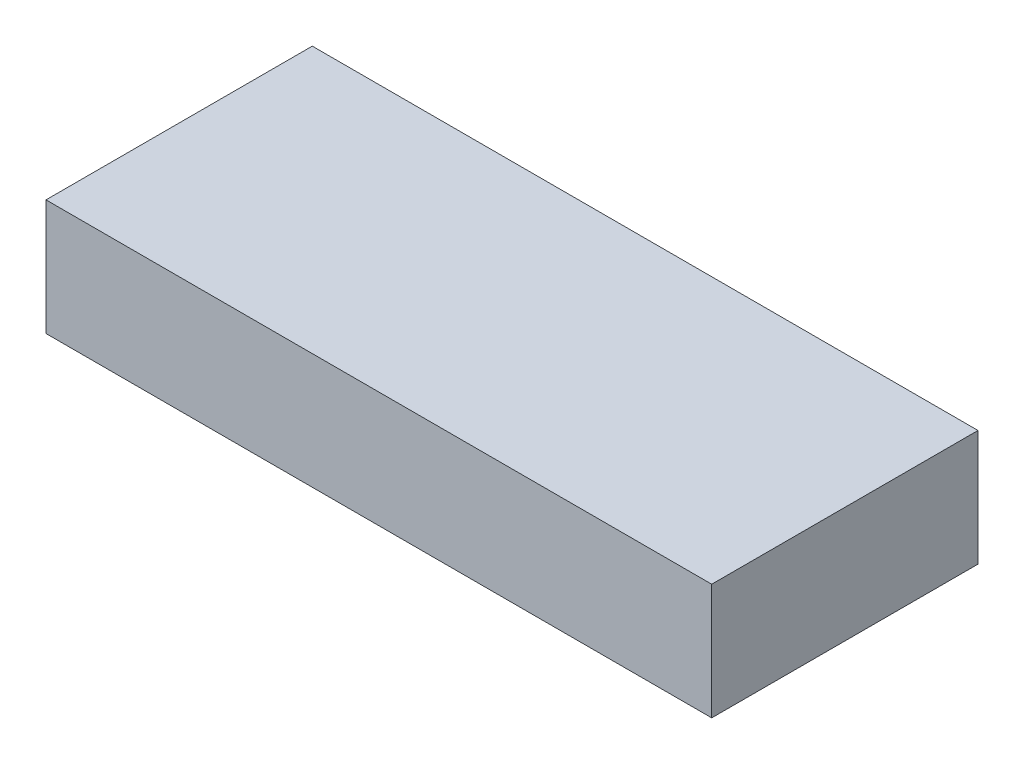
ISO-10303-21;
HEADER;
FILE_DESCRIPTION(('STEP AP214'),'2;1');
FILE_NAME('part.step','',(''),(''),'','','');
FILE_SCHEMA(('AUTOMOTIVE_DESIGN { 1 0 10303 214 1 1 1 1 }'));
ENDSEC;
DATA;
#1=APPLICATION_CONTEXT('core data for automotive mechanical design processes');
#2=APPLICATION_PROTOCOL_DEFINITION('international standard','automotive_design',2000,#1);
#3=PRODUCT_CONTEXT('',#1,'mechanical');
#4=PRODUCT('Part','Part','',(#3));
#5=PRODUCT_RELATED_PRODUCT_CATEGORY('part','',(#4));
#6=PRODUCT_DEFINITION_FORMATION('','',#4);
#7=PRODUCT_DEFINITION_CONTEXT('part definition',#1,'design');
#8=PRODUCT_DEFINITION('design','',#6,#7);
#9=PRODUCT_DEFINITION_SHAPE('','',#8);
#10=(LENGTH_UNIT() NAMED_UNIT(*) SI_UNIT(.MILLI.,.METRE.));
#11=(NAMED_UNIT(*) PLANE_ANGLE_UNIT() SI_UNIT($,.RADIAN.));
#12=(NAMED_UNIT(*) SI_UNIT($,.STERADIAN.) SOLID_ANGLE_UNIT());
#13=UNCERTAINTY_MEASURE_WITH_UNIT(LENGTH_MEASURE(1.E-05),#10,'distance_accuracy_value','');
#14=(GEOMETRIC_REPRESENTATION_CONTEXT(3) GLOBAL_UNCERTAINTY_ASSIGNED_CONTEXT((#13)) GLOBAL_UNIT_ASSIGNED_CONTEXT((#10,
#11,#12)) REPRESENTATION_CONTEXT('',''));
#15=CARTESIAN_POINT('',(0.,0.,0.));
#16=DIRECTION('',(0.,0.,1.));
#17=DIRECTION('',(1.,0.,0.));
#18=AXIS2_PLACEMENT_3D('',#15,#16,#17);
#19=CARTESIAN_POINT('',(57.5,20.,23.));
#20=DIRECTION('',(0.,0.,-1.));
#21=DIRECTION('',(-1.,0.,0.));
#22=AXIS2_PLACEMENT_3D('',#19,#20,#21);
#23=PLANE('',#22);
#24=DIRECTION('',(1.,0.,0.));
#25=VECTOR('',#24,1.);
#26=CARTESIAN_POINT('',(57.5,0.,23.));
#27=LINE('',#26,#25);
#28=CARTESIAN_POINT('',(-57.5,0.,23.));
#29=VERTEX_POINT('',#28);
#30=CARTESIAN_POINT('',(57.5,0.,23.));
#31=VERTEX_POINT('',#30);
#32=EDGE_CURVE('E98',#29,#31,#27,.T.);
#33=ORIENTED_EDGE('',*,*,#32,.T.);
#34=DIRECTION('',(0.,-1.,0.));
#35=VECTOR('',#34,1.);
#36=CARTESIAN_POINT('',(57.5,20.,23.));
#37=LINE('',#36,#35);
#38=CARTESIAN_POINT('',(57.5,20.,23.));
#39=VERTEX_POINT('',#38);
#40=EDGE_CURVE('E11',#39,#31,#37,.T.);
#41=ORIENTED_EDGE('',*,*,#40,.F.);
#42=DIRECTION('',(1.,0.,0.));
#43=VECTOR('',#42,1.);
#44=CARTESIAN_POINT('',(57.5,20.,23.));
#45=LINE('',#44,#43);
#46=CARTESIAN_POINT('',(-57.5,20.,23.));
#47=VERTEX_POINT('',#46);
#48=EDGE_CURVE('E86',#47,#39,#45,.T.);
#49=ORIENTED_EDGE('',*,*,#48,.F.);
#50=DIRECTION('',(0.,-1.,0.));
#51=VECTOR('',#50,1.);
#52=CARTESIAN_POINT('',(-57.5,20.,23.));
#53=LINE('',#52,#51);
#54=EDGE_CURVE('E94',#47,#29,#53,.T.);
#55=ORIENTED_EDGE('',*,*,#54,.T.);
#56=EDGE_LOOP('',(#33,#41,#49,#55));
#57=FACE_BOUND('',#56,.T.);
#58=ADVANCED_FACE('F35',(#57),#23,.F.);
#59=CARTESIAN_POINT('',(57.5,20.,-23.));
#60=DIRECTION('',(-1.,0.,0.));
#61=DIRECTION('',(0.,0.,1.));
#62=AXIS2_PLACEMENT_3D('',#59,#60,#61);
#63=PLANE('',#62);
#64=DIRECTION('',(0.,0.,-1.));
#65=VECTOR('',#64,1.);
#66=CARTESIAN_POINT('',(57.5,0.,-23.));
#67=LINE('',#66,#65);
#68=CARTESIAN_POINT('',(57.5,0.,-23.));
#69=VERTEX_POINT('',#68);
#70=EDGE_CURVE('E90',#31,#69,#67,.T.);
#71=ORIENTED_EDGE('',*,*,#70,.T.);
#72=DIRECTION('',(0.,-1.,0.));
#73=VECTOR('',#72,1.);
#74=CARTESIAN_POINT('',(57.5,20.,-23.));
#75=LINE('',#74,#73);
#76=CARTESIAN_POINT('',(57.5,20.,-23.));
#77=VERTEX_POINT('',#76);
#78=EDGE_CURVE('E43',#77,#69,#75,.T.);
#79=ORIENTED_EDGE('',*,*,#78,.F.);
#80=DIRECTION('',(0.,0.,-1.));
#81=VECTOR('',#80,1.);
#82=CARTESIAN_POINT('',(57.5,20.,-23.));
#83=LINE('',#82,#81);
#84=EDGE_CURVE('E81',#39,#77,#83,.T.);
#85=ORIENTED_EDGE('',*,*,#84,.F.);
#86=ORIENTED_EDGE('',*,*,#40,.T.);
#87=EDGE_LOOP('',(#71,#79,#85,#86));
#88=FACE_BOUND('',#87,.T.);
#89=ADVANCED_FACE('F89',(#88),#63,.F.);
#90=CARTESIAN_POINT('',(-57.5,20.,-23.));
#91=DIRECTION('',(0.,0.,1.));
#92=DIRECTION('',(1.,0.,0.));
#93=AXIS2_PLACEMENT_3D('',#90,#91,#92);
#94=PLANE('',#93);
#95=DIRECTION('',(-1.,0.,0.));
#96=VECTOR('',#95,1.);
#97=CARTESIAN_POINT('',(-57.5,0.,-23.));
#98=LINE('',#97,#96);
#99=CARTESIAN_POINT('',(-57.5,0.,-23.));
#100=VERTEX_POINT('',#99);
#101=EDGE_CURVE('E68',#69,#100,#98,.T.);
#102=ORIENTED_EDGE('',*,*,#101,.T.);
#103=DIRECTION('',(0.,-1.,0.));
#104=VECTOR('',#103,1.);
#105=CARTESIAN_POINT('',(-57.5,20.,-23.));
#106=LINE('',#105,#104);
#107=CARTESIAN_POINT('',(-57.5,20.,-23.));
#108=VERTEX_POINT('',#107);
#109=EDGE_CURVE('E91',#108,#100,#106,.T.);
#110=ORIENTED_EDGE('',*,*,#109,.F.);
#111=DIRECTION('',(-1.,0.,0.));
#112=VECTOR('',#111,1.);
#113=CARTESIAN_POINT('',(-57.5,20.,-23.));
#114=LINE('',#113,#112);
#115=EDGE_CURVE('E84',#77,#108,#114,.T.);
#116=ORIENTED_EDGE('',*,*,#115,.F.);
#117=ORIENTED_EDGE('',*,*,#78,.T.);
#118=EDGE_LOOP('',(#102,#110,#116,#117));
#119=FACE_BOUND('',#118,.T.);
#120=ADVANCED_FACE('F92',(#119),#94,.F.);
#121=CARTESIAN_POINT('',(-57.5,20.,23.));
#122=DIRECTION('',(1.,0.,0.));
#123=DIRECTION('',(0.,0.,-1.));
#124=AXIS2_PLACEMENT_3D('',#121,#122,#123);
#125=PLANE('',#124);
#126=DIRECTION('',(0.,0.,1.));
#127=VECTOR('',#126,1.);
#128=CARTESIAN_POINT('',(-57.5,0.,23.));
#129=LINE('',#128,#127);
#130=EDGE_CURVE('E74',#100,#29,#129,.T.);
#131=ORIENTED_EDGE('',*,*,#130,.T.);
#132=ORIENTED_EDGE('',*,*,#54,.F.);
#133=DIRECTION('',(0.,0.,1.));
#134=VECTOR('',#133,1.);
#135=CARTESIAN_POINT('',(-57.5,20.,23.));
#136=LINE('',#135,#134);
#137=EDGE_CURVE('E51',#108,#47,#136,.T.);
#138=ORIENTED_EDGE('',*,*,#137,.F.);
#139=ORIENTED_EDGE('',*,*,#109,.T.);
#140=EDGE_LOOP('',(#131,#132,#138,#139));
#141=FACE_BOUND('',#140,.T.);
#142=ADVANCED_FACE('F105',(#141),#125,.F.);
#143=CARTESIAN_POINT('',(0.,20.,0.));
#144=DIRECTION('',(0.,-1.,0.));
#145=DIRECTION('',(0.,0.,-1.));
#146=AXIS2_PLACEMENT_3D('',#143,#144,#145);
#147=PLANE('',#146);
#148=ORIENTED_EDGE('',*,*,#48,.T.);
#149=ORIENTED_EDGE('',*,*,#84,.T.);
#150=ORIENTED_EDGE('',*,*,#115,.T.);
#151=ORIENTED_EDGE('',*,*,#137,.T.);
#152=EDGE_LOOP('',(#148,#149,#150,#151));
#153=FACE_BOUND('',#152,.T.);
#154=ADVANCED_FACE('F82',(#153),#147,.F.);
#155=CARTESIAN_POINT('',(0.,0.,0.));
#156=DIRECTION('',(0.,-1.,0.));
#157=DIRECTION('',(0.,0.,-1.));
#158=AXIS2_PLACEMENT_3D('',#155,#156,#157);
#159=PLANE('',#158);
#160=ORIENTED_EDGE('',*,*,#32,.F.);
#161=ORIENTED_EDGE('',*,*,#130,.F.);
#162=ORIENTED_EDGE('',*,*,#101,.F.);
#163=ORIENTED_EDGE('',*,*,#70,.F.);
#164=EDGE_LOOP('',(#160,#161,#162,#163));
#165=FACE_BOUND('',#164,.T.);
#166=ADVANCED_FACE('F108',(#165),#159,.T.);
#167=CLOSED_SHELL('',(#58,#89,#120,#142,#154,#166));
#168=MANIFOLD_SOLID_BREP('B2',#167);
#169=ADVANCED_BREP_SHAPE_REPRESENTATION('',(#18,#168),#14);
#170=SHAPE_DEFINITION_REPRESENTATION(#9,#169);
ENDSEC;
END-ISO-10303-21;
